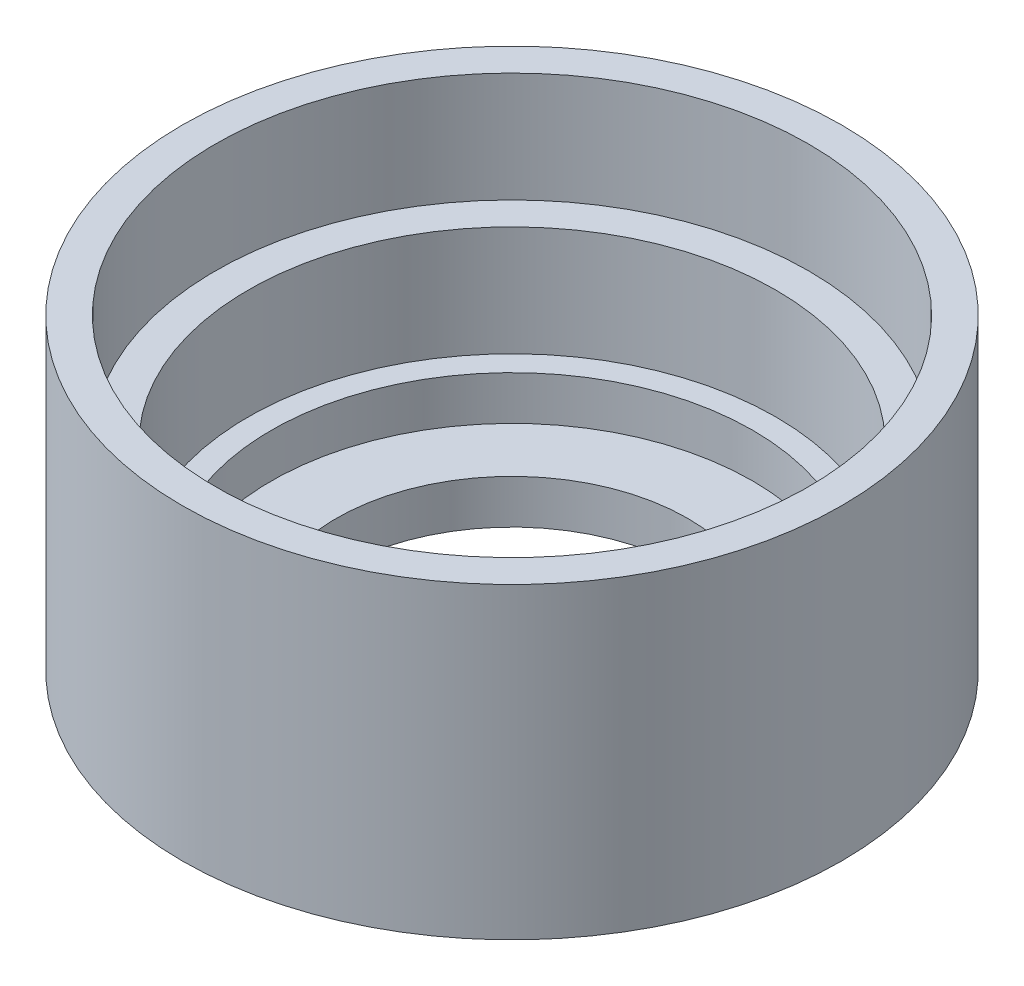
ISO-10303-21;
HEADER;
FILE_DESCRIPTION(('STEP AP214'),'2;1');
FILE_NAME('part.step','',(''),(''),'','','');
FILE_SCHEMA(('AUTOMOTIVE_DESIGN { 1 0 10303 214 1 1 1 1 }'));
ENDSEC;
DATA;
#1=APPLICATION_CONTEXT('core data for automotive mechanical design processes');
#2=APPLICATION_PROTOCOL_DEFINITION('international standard','automotive_design',2000,#1);
#3=PRODUCT_CONTEXT('',#1,'mechanical');
#4=PRODUCT('Part','Part','',(#3));
#5=PRODUCT_RELATED_PRODUCT_CATEGORY('part','',(#4));
#6=PRODUCT_DEFINITION_FORMATION('','',#4);
#7=PRODUCT_DEFINITION_CONTEXT('part definition',#1,'design');
#8=PRODUCT_DEFINITION('design','',#6,#7);
#9=PRODUCT_DEFINITION_SHAPE('','',#8);
#10=(LENGTH_UNIT() NAMED_UNIT(*) SI_UNIT(.MILLI.,.METRE.));
#11=(NAMED_UNIT(*) PLANE_ANGLE_UNIT() SI_UNIT($,.RADIAN.));
#12=(NAMED_UNIT(*) SI_UNIT($,.STERADIAN.) SOLID_ANGLE_UNIT());
#13=UNCERTAINTY_MEASURE_WITH_UNIT(LENGTH_MEASURE(1.E-05),#10,'distance_accuracy_value','');
#14=(GEOMETRIC_REPRESENTATION_CONTEXT(3) GLOBAL_UNCERTAINTY_ASSIGNED_CONTEXT((#13)) GLOBAL_UNIT_ASSIGNED_CONTEXT((#10,
#11,#12)) REPRESENTATION_CONTEXT('',''));
#15=CARTESIAN_POINT('',(0.,0.,0.));
#16=DIRECTION('',(0.,0.,1.));
#17=DIRECTION('',(1.,0.,0.));
#18=AXIS2_PLACEMENT_3D('',#15,#16,#17);
#19=CARTESIAN_POINT('',(0.,0.,0.));
#20=DIRECTION('',(0.,-1.,0.));
#21=DIRECTION('',(0.,0.,-1.));
#22=AXIS2_PLACEMENT_3D('',#19,#20,#21);
#23=CYLINDRICAL_SURFACE('',#22,8.);
#24=CARTESIAN_POINT('',(0.,0.,0.));
#25=DIRECTION('',(0.,-1.,0.));
#26=DIRECTION('',(0.,0.,-1.));
#27=AXIS2_PLACEMENT_3D('',#24,#25,#26);
#28=CIRCLE('',#27,8.);
#29=CARTESIAN_POINT('',(0.,0.,-8.));
#30=VERTEX_POINT('',#29);
#31=EDGE_CURVE('E10',#30,#30,#28,.T.);
#32=ORIENTED_EDGE('',*,*,#31,.T.);
#33=EDGE_LOOP('',(#32));
#34=FACE_BOUND('',#33,.T.);
#35=CARTESIAN_POINT('',(0.,2.,0.));
#36=DIRECTION('',(0.,-1.,0.));
#37=DIRECTION('',(0.,0.,-1.));
#38=AXIS2_PLACEMENT_3D('',#35,#36,#37);
#39=CIRCLE('',#38,8.);
#40=CARTESIAN_POINT('',(0.,2.,-8.));
#41=VERTEX_POINT('',#40);
#42=EDGE_CURVE('E67',#41,#41,#39,.T.);
#43=ORIENTED_EDGE('',*,*,#42,.F.);
#44=EDGE_LOOP('',(#43));
#45=FACE_BOUND('',#44,.T.);
#46=ADVANCED_FACE('F33',(#34,#45),#23,.F.);
#47=CARTESIAN_POINT('',(8.,0.,0.));
#48=DIRECTION('',(0.,-1.,0.));
#49=DIRECTION('',(0.,0.,-1.));
#50=AXIS2_PLACEMENT_3D('',#47,#48,#49);
#51=PLANE('',#50);
#52=CARTESIAN_POINT('',(0.,0.,0.));
#53=DIRECTION('',(0.,-1.,0.));
#54=DIRECTION('',(0.,0.,-1.));
#55=AXIS2_PLACEMENT_3D('',#52,#53,#54);
#56=CIRCLE('',#55,15.);
#57=CARTESIAN_POINT('',(0.,0.,-15.));
#58=VERTEX_POINT('',#57);
#59=EDGE_CURVE('E39',#58,#58,#56,.T.);
#60=ORIENTED_EDGE('',*,*,#59,.T.);
#61=EDGE_LOOP('',(#60));
#62=FACE_BOUND('',#61,.T.);
#63=ORIENTED_EDGE('',*,*,#31,.F.);
#64=EDGE_LOOP('',(#63));
#65=FACE_BOUND('',#64,.T.);
#66=ADVANCED_FACE('F75',(#62,#65),#51,.T.);
#67=CARTESIAN_POINT('',(0.,0.,0.));
#68=DIRECTION('',(0.,-1.,0.));
#69=DIRECTION('',(0.,0.,-1.));
#70=AXIS2_PLACEMENT_3D('',#67,#68,#69);
#71=CYLINDRICAL_SURFACE('',#70,15.);
#72=CARTESIAN_POINT('',(0.,14.,0.));
#73=DIRECTION('',(0.,-1.,0.));
#74=DIRECTION('',(0.,0.,-1.));
#75=AXIS2_PLACEMENT_3D('',#72,#73,#74);
#76=CIRCLE('',#75,15.);
#77=CARTESIAN_POINT('',(0.,14.,-15.));
#78=VERTEX_POINT('',#77);
#79=EDGE_CURVE('E43',#78,#78,#76,.T.);
#80=ORIENTED_EDGE('',*,*,#79,.T.);
#81=EDGE_LOOP('',(#80));
#82=FACE_BOUND('',#81,.T.);
#83=ORIENTED_EDGE('',*,*,#59,.F.);
#84=EDGE_LOOP('',(#83));
#85=FACE_BOUND('',#84,.T.);
#86=ADVANCED_FACE('F79',(#82,#85),#71,.T.);
#87=CARTESIAN_POINT('',(15.,14.,0.));
#88=DIRECTION('',(0.,1.,0.));
#89=DIRECTION('',(0.,0.,1.));
#90=AXIS2_PLACEMENT_3D('',#87,#88,#89);
#91=PLANE('',#90);
#92=CARTESIAN_POINT('',(0.,14.,0.));
#93=DIRECTION('',(0.,-1.,0.));
#94=DIRECTION('',(0.,0.,-1.));
#95=AXIS2_PLACEMENT_3D('',#92,#93,#94);
#96=CIRCLE('',#95,13.5);
#97=CARTESIAN_POINT('',(0.,14.,-13.5));
#98=VERTEX_POINT('',#97);
#99=EDGE_CURVE('E47',#98,#98,#96,.T.);
#100=ORIENTED_EDGE('',*,*,#99,.T.);
#101=EDGE_LOOP('',(#100));
#102=FACE_BOUND('',#101,.T.);
#103=ORIENTED_EDGE('',*,*,#79,.F.);
#104=EDGE_LOOP('',(#103));
#105=FACE_BOUND('',#104,.T.);
#106=ADVANCED_FACE('F83',(#102,#105),#91,.T.);
#107=CARTESIAN_POINT('',(0.,0.,0.));
#108=DIRECTION('',(0.,-1.,0.));
#109=DIRECTION('',(0.,0.,-1.));
#110=AXIS2_PLACEMENT_3D('',#107,#108,#109);
#111=CYLINDRICAL_SURFACE('',#110,13.5);
#112=CARTESIAN_POINT('',(0.,9.,0.));
#113=DIRECTION('',(0.,-1.,0.));
#114=DIRECTION('',(0.,0.,-1.));
#115=AXIS2_PLACEMENT_3D('',#112,#113,#114);
#116=CIRCLE('',#115,13.5);
#117=CARTESIAN_POINT('',(0.,9.,-13.5));
#118=VERTEX_POINT('',#117);
#119=EDGE_CURVE('E52',#118,#118,#116,.T.);
#120=ORIENTED_EDGE('',*,*,#119,.T.);
#121=EDGE_LOOP('',(#120));
#122=FACE_BOUND('',#121,.T.);
#123=ORIENTED_EDGE('',*,*,#99,.F.);
#124=EDGE_LOOP('',(#123));
#125=FACE_BOUND('',#124,.T.);
#126=ADVANCED_FACE('F90',(#122,#125),#111,.F.);
#127=CARTESIAN_POINT('',(13.5,9.,0.));
#128=DIRECTION('',(0.,1.,0.));
#129=DIRECTION('',(0.,0.,1.));
#130=AXIS2_PLACEMENT_3D('',#127,#128,#129);
#131=PLANE('',#130);
#132=CARTESIAN_POINT('',(0.,9.,0.));
#133=DIRECTION('',(0.,-1.,0.));
#134=DIRECTION('',(0.,0.,-1.));
#135=AXIS2_PLACEMENT_3D('',#132,#133,#134);
#136=CIRCLE('',#135,12.);
#137=CARTESIAN_POINT('',(0.,9.,-12.));
#138=VERTEX_POINT('',#137);
#139=EDGE_CURVE('E55',#138,#138,#136,.T.);
#140=ORIENTED_EDGE('',*,*,#139,.T.);
#141=EDGE_LOOP('',(#140));
#142=FACE_BOUND('',#141,.T.);
#143=ORIENTED_EDGE('',*,*,#119,.F.);
#144=EDGE_LOOP('',(#143));
#145=FACE_BOUND('',#144,.T.);
#146=ADVANCED_FACE('F94',(#142,#145),#131,.T.);
#147=CARTESIAN_POINT('',(0.,0.,0.));
#148=DIRECTION('',(0.,-1.,0.));
#149=DIRECTION('',(0.,0.,-1.));
#150=AXIS2_PLACEMENT_3D('',#147,#148,#149);
#151=CYLINDRICAL_SURFACE('',#150,12.);
#152=CARTESIAN_POINT('',(0.,4.,0.));
#153=DIRECTION('',(0.,-1.,0.));
#154=DIRECTION('',(0.,0.,-1.));
#155=AXIS2_PLACEMENT_3D('',#152,#153,#154);
#156=CIRCLE('',#155,12.);
#157=CARTESIAN_POINT('',(0.,4.,-12.));
#158=VERTEX_POINT('',#157);
#159=EDGE_CURVE('E58',#158,#158,#156,.T.);
#160=ORIENTED_EDGE('',*,*,#159,.T.);
#161=EDGE_LOOP('',(#160));
#162=FACE_BOUND('',#161,.T.);
#163=ORIENTED_EDGE('',*,*,#139,.F.);
#164=EDGE_LOOP('',(#163));
#165=FACE_BOUND('',#164,.T.);
#166=ADVANCED_FACE('F98',(#162,#165),#151,.F.);
#167=CARTESIAN_POINT('',(12.,4.,0.));
#168=DIRECTION('',(0.,1.,0.));
#169=DIRECTION('',(0.,0.,1.));
#170=AXIS2_PLACEMENT_3D('',#167,#168,#169);
#171=PLANE('',#170);
#172=CARTESIAN_POINT('',(0.,4.,0.));
#173=DIRECTION('',(0.,-1.,0.));
#174=DIRECTION('',(0.,0.,-1.));
#175=AXIS2_PLACEMENT_3D('',#172,#173,#174);
#176=CIRCLE('',#175,10.95);
#177=CARTESIAN_POINT('',(0.,4.,-10.95));
#178=VERTEX_POINT('',#177);
#179=EDGE_CURVE('E61',#178,#178,#176,.T.);
#180=ORIENTED_EDGE('',*,*,#179,.T.);
#181=EDGE_LOOP('',(#180));
#182=FACE_BOUND('',#181,.T.);
#183=ORIENTED_EDGE('',*,*,#159,.F.);
#184=EDGE_LOOP('',(#183));
#185=FACE_BOUND('',#184,.T.);
#186=ADVANCED_FACE('F102',(#182,#185),#171,.T.);
#187=CARTESIAN_POINT('',(0.,0.,0.));
#188=DIRECTION('',(0.,-1.,0.));
#189=DIRECTION('',(0.,0.,-1.));
#190=AXIS2_PLACEMENT_3D('',#187,#188,#189);
#191=CYLINDRICAL_SURFACE('',#190,10.95);
#192=CARTESIAN_POINT('',(0.,2.,0.));
#193=DIRECTION('',(0.,-1.,0.));
#194=DIRECTION('',(0.,0.,-1.));
#195=AXIS2_PLACEMENT_3D('',#192,#193,#194);
#196=CIRCLE('',#195,10.95);
#197=CARTESIAN_POINT('',(0.,2.,-10.95));
#198=VERTEX_POINT('',#197);
#199=EDGE_CURVE('E64',#198,#198,#196,.T.);
#200=ORIENTED_EDGE('',*,*,#199,.T.);
#201=EDGE_LOOP('',(#200));
#202=FACE_BOUND('',#201,.T.);
#203=ORIENTED_EDGE('',*,*,#179,.F.);
#204=EDGE_LOOP('',(#203));
#205=FACE_BOUND('',#204,.T.);
#206=ADVANCED_FACE('F106',(#202,#205),#191,.F.);
#207=CARTESIAN_POINT('',(10.95,2.,0.));
#208=DIRECTION('',(0.,1.,0.));
#209=DIRECTION('',(0.,0.,1.));
#210=AXIS2_PLACEMENT_3D('',#207,#208,#209);
#211=PLANE('',#210);
#212=ORIENTED_EDGE('',*,*,#42,.T.);
#213=EDGE_LOOP('',(#212));
#214=FACE_BOUND('',#213,.T.);
#215=ORIENTED_EDGE('',*,*,#199,.F.);
#216=EDGE_LOOP('',(#215));
#217=FACE_BOUND('',#216,.T.);
#218=ADVANCED_FACE('F71',(#214,#217),#211,.T.);
#219=CLOSED_SHELL('',(#46,#66,#86,#106,#126,#146,#166,#186,#206,#218));
#220=MANIFOLD_SOLID_BREP('B2',#219);
#221=ADVANCED_BREP_SHAPE_REPRESENTATION('',(#18,#220),#14);
#222=SHAPE_DEFINITION_REPRESENTATION(#9,#221);
ENDSEC;
END-ISO-10303-21;
